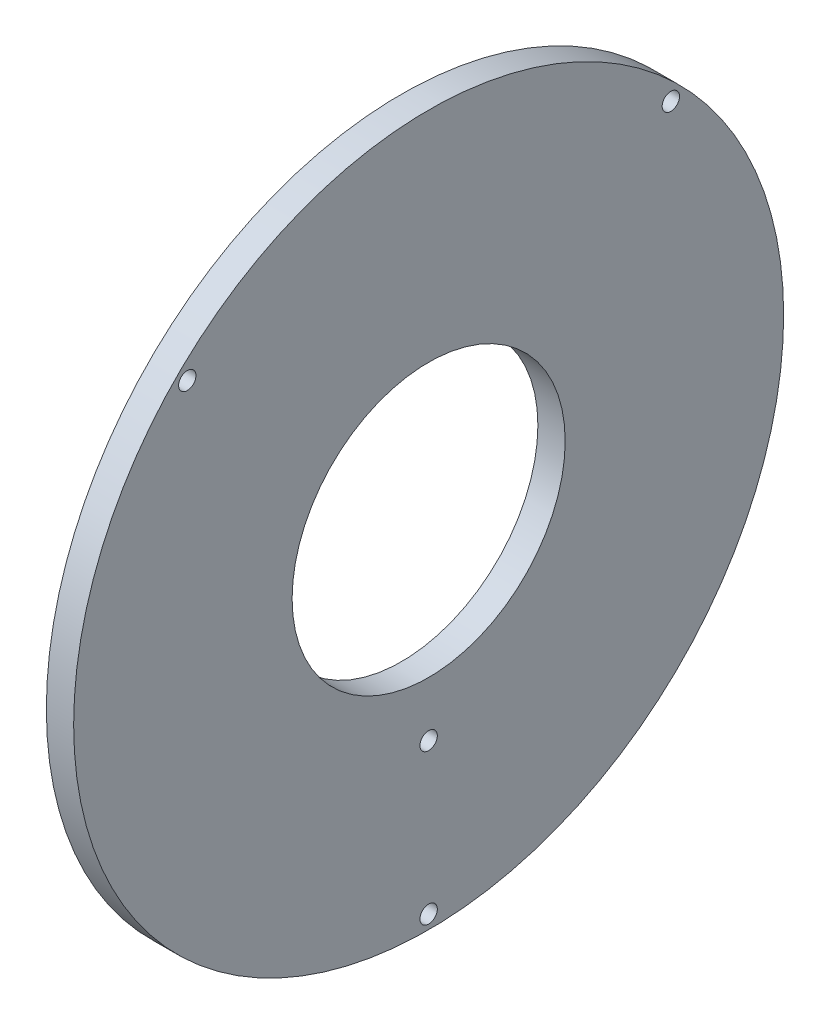
ISO-10303-21;
HEADER;
FILE_DESCRIPTION(('STEP AP214'),'2;1');
FILE_NAME('part.step','',(''),(''),'','','');
FILE_SCHEMA(('AUTOMOTIVE_DESIGN { 1 0 10303 214 1 1 1 1 }'));
ENDSEC;
DATA;
#1=APPLICATION_CONTEXT('core data for automotive mechanical design processes');
#2=APPLICATION_PROTOCOL_DEFINITION('international standard','automotive_design',2000,#1);
#3=PRODUCT_CONTEXT('',#1,'mechanical');
#4=PRODUCT('Part','Part','',(#3));
#5=PRODUCT_RELATED_PRODUCT_CATEGORY('part','',(#4));
#6=PRODUCT_DEFINITION_FORMATION('','',#4);
#7=PRODUCT_DEFINITION_CONTEXT('part definition',#1,'design');
#8=PRODUCT_DEFINITION('design','',#6,#7);
#9=PRODUCT_DEFINITION_SHAPE('','',#8);
#10=(LENGTH_UNIT() NAMED_UNIT(*) SI_UNIT(.MILLI.,.METRE.));
#11=(NAMED_UNIT(*) PLANE_ANGLE_UNIT() SI_UNIT($,.RADIAN.));
#12=(NAMED_UNIT(*) SI_UNIT($,.STERADIAN.) SOLID_ANGLE_UNIT());
#13=UNCERTAINTY_MEASURE_WITH_UNIT(LENGTH_MEASURE(1.E-05),#10,'distance_accuracy_value','');
#14=(GEOMETRIC_REPRESENTATION_CONTEXT(3) GLOBAL_UNCERTAINTY_ASSIGNED_CONTEXT((#13)) GLOBAL_UNIT_ASSIGNED_CONTEXT((#10,
#11,#12)) REPRESENTATION_CONTEXT('',''));
#15=CARTESIAN_POINT('',(0.,0.,0.));
#16=DIRECTION('',(0.,0.,1.));
#17=DIRECTION('',(1.,0.,0.));
#18=AXIS2_PLACEMENT_3D('',#15,#16,#17);
#19=CARTESIAN_POINT('',(20.,0.,0.));
#20=DIRECTION('',(-1.,0.,0.));
#21=DIRECTION('',(0.,0.,1.));
#22=AXIS2_PLACEMENT_3D('',#19,#20,#21);
#23=CYLINDRICAL_SURFACE('',#22,260.);
#24=CARTESIAN_POINT('',(20.,0.,0.));
#25=DIRECTION('',(1.,0.,0.));
#26=DIRECTION('',(0.,0.,-1.));
#27=AXIS2_PLACEMENT_3D('',#24,#25,#26);
#28=CIRCLE('',#27,260.);
#29=CARTESIAN_POINT('',(20.,0.,-260.));
#30=VERTEX_POINT('',#29);
#31=EDGE_CURVE('E11',#30,#30,#28,.T.);
#32=ORIENTED_EDGE('',*,*,#31,.F.);
#33=EDGE_LOOP('',(#32));
#34=FACE_BOUND('',#33,.T.);
#35=CARTESIAN_POINT('',(0.,0.,0.));
#36=DIRECTION('',(1.,0.,0.));
#37=DIRECTION('',(0.,0.,-1.));
#38=AXIS2_PLACEMENT_3D('',#35,#36,#37);
#39=CIRCLE('',#38,260.);
#40=CARTESIAN_POINT('',(0.,0.,-260.));
#41=VERTEX_POINT('',#40);
#42=EDGE_CURVE('E38',#41,#41,#39,.T.);
#43=ORIENTED_EDGE('',*,*,#42,.T.);
#44=EDGE_LOOP('',(#43));
#45=FACE_BOUND('',#44,.T.);
#46=ADVANCED_FACE('F31',(#34,#45),#23,.T.);
#47=CARTESIAN_POINT('',(20.,0.,0.));
#48=DIRECTION('',(1.,0.,0.));
#49=DIRECTION('',(0.,0.,-1.));
#50=AXIS2_PLACEMENT_3D('',#47,#48,#49);
#51=PLANE('',#50);
#52=CARTESIAN_POINT('',(20.,176.776695296637,-177.367627121048));
#53=DIRECTION('',(1.,0.,0.));
#54=DIRECTION('',(0.,0.,-1.));
#55=AXIS2_PLACEMENT_3D('',#52,#53,#54);
#56=CIRCLE('',#55,6.34999999999999);
#57=CARTESIAN_POINT('',(20.,176.776695296637,-183.717627121048));
#58=VERTEX_POINT('',#57);
#59=EDGE_CURVE('E68',#58,#58,#56,.T.);
#60=ORIENTED_EDGE('',*,*,#59,.F.);
#61=EDGE_LOOP('',(#60));
#62=FACE_BOUND('',#61,.T.);
#63=CARTESIAN_POINT('',(20.,176.776695296637,176.776695296637));
#64=DIRECTION('',(1.,0.,0.));
#65=DIRECTION('',(0.,0.,-1.));
#66=AXIS2_PLACEMENT_3D('',#63,#64,#65);
#67=CIRCLE('',#66,6.34999999999999);
#68=CARTESIAN_POINT('',(20.,176.776695296637,170.426695296637));
#69=VERTEX_POINT('',#68);
#70=EDGE_CURVE('E58',#69,#69,#67,.T.);
#71=ORIENTED_EDGE('',*,*,#70,.F.);
#72=EDGE_LOOP('',(#71));
#73=FACE_BOUND('',#72,.T.);
#74=CARTESIAN_POINT('',(20.,-250.,0.));
#75=DIRECTION('',(1.,0.,0.));
#76=DIRECTION('',(0.,0.,-1.));
#77=AXIS2_PLACEMENT_3D('',#74,#75,#76);
#78=CIRCLE('',#77,6.34999999999999);
#79=CARTESIAN_POINT('',(20.,-250.,-6.34999999999999));
#80=VERTEX_POINT('',#79);
#81=EDGE_CURVE('E55',#80,#80,#78,.T.);
#82=ORIENTED_EDGE('',*,*,#81,.F.);
#83=EDGE_LOOP('',(#82));
#84=FACE_BOUND('',#83,.T.);
#85=CARTESIAN_POINT('',(20.,-140.,0.));
#86=DIRECTION('',(1.,0.,0.));
#87=DIRECTION('',(0.,0.,-1.));
#88=AXIS2_PLACEMENT_3D('',#85,#86,#87);
#89=CIRCLE('',#88,6.34999999999999);
#90=CARTESIAN_POINT('',(20.,-140.,-6.34999999999999));
#91=VERTEX_POINT('',#90);
#92=EDGE_CURVE('E52',#91,#91,#89,.T.);
#93=ORIENTED_EDGE('',*,*,#92,.F.);
#94=EDGE_LOOP('',(#93));
#95=FACE_BOUND('',#94,.T.);
#96=CARTESIAN_POINT('',(20.,0.,0.));
#97=DIRECTION('',(1.,0.,0.));
#98=DIRECTION('',(0.,0.,-1.));
#99=AXIS2_PLACEMENT_3D('',#96,#97,#98);
#100=CIRCLE('',#99,100.);
#101=CARTESIAN_POINT('',(20.,0.,-100.));
#102=VERTEX_POINT('',#101);
#103=EDGE_CURVE('E46',#102,#102,#100,.T.);
#104=ORIENTED_EDGE('',*,*,#103,.F.);
#105=EDGE_LOOP('',(#104));
#106=FACE_BOUND('',#105,.T.);
#107=ORIENTED_EDGE('',*,*,#31,.T.);
#108=EDGE_LOOP('',(#107));
#109=FACE_BOUND('',#108,.T.);
#110=ADVANCED_FACE('F80',(#62,#73,#84,#95,#106,#109),#51,.T.);
#111=CARTESIAN_POINT('',(0.,0.,0.));
#112=DIRECTION('',(1.,0.,0.));
#113=DIRECTION('',(0.,0.,-1.));
#114=AXIS2_PLACEMENT_3D('',#111,#112,#113);
#115=PLANE('',#114);
#116=CARTESIAN_POINT('',(0.,176.776695296637,-177.367627121048));
#117=DIRECTION('',(1.,0.,0.));
#118=DIRECTION('',(0.,0.,-1.));
#119=AXIS2_PLACEMENT_3D('',#116,#117,#118);
#120=CIRCLE('',#119,6.34999999999999);
#121=CARTESIAN_POINT('',(0.,176.776695296637,-183.717627121048));
#122=VERTEX_POINT('',#121);
#123=EDGE_CURVE('E34',#122,#122,#120,.T.);
#124=ORIENTED_EDGE('',*,*,#123,.T.);
#125=EDGE_LOOP('',(#124));
#126=FACE_BOUND('',#125,.T.);
#127=CARTESIAN_POINT('',(0.,176.776695296637,176.776695296637));
#128=DIRECTION('',(1.,0.,0.));
#129=DIRECTION('',(0.,0.,-1.));
#130=AXIS2_PLACEMENT_3D('',#127,#128,#129);
#131=CIRCLE('',#130,6.34999999999999);
#132=CARTESIAN_POINT('',(0.,176.776695296637,170.426695296637));
#133=VERTEX_POINT('',#132);
#134=EDGE_CURVE('E56',#133,#133,#131,.T.);
#135=ORIENTED_EDGE('',*,*,#134,.T.);
#136=EDGE_LOOP('',(#135));
#137=FACE_BOUND('',#136,.T.);
#138=CARTESIAN_POINT('',(0.,-250.,0.));
#139=DIRECTION('',(1.,0.,0.));
#140=DIRECTION('',(0.,0.,-1.));
#141=AXIS2_PLACEMENT_3D('',#138,#139,#140);
#142=CIRCLE('',#141,6.34999999999999);
#143=CARTESIAN_POINT('',(0.,-250.,-6.34999999999999));
#144=VERTEX_POINT('',#143);
#145=EDGE_CURVE('E53',#144,#144,#142,.T.);
#146=ORIENTED_EDGE('',*,*,#145,.T.);
#147=EDGE_LOOP('',(#146));
#148=FACE_BOUND('',#147,.T.);
#149=CARTESIAN_POINT('',(0.,-140.,0.));
#150=DIRECTION('',(1.,0.,0.));
#151=DIRECTION('',(0.,0.,-1.));
#152=AXIS2_PLACEMENT_3D('',#149,#150,#151);
#153=CIRCLE('',#152,6.34999999999999);
#154=CARTESIAN_POINT('',(0.,-140.,-6.34999999999999));
#155=VERTEX_POINT('',#154);
#156=EDGE_CURVE('E49',#155,#155,#153,.T.);
#157=ORIENTED_EDGE('',*,*,#156,.T.);
#158=EDGE_LOOP('',(#157));
#159=FACE_BOUND('',#158,.T.);
#160=CARTESIAN_POINT('',(0.,0.,0.));
#161=DIRECTION('',(1.,0.,0.));
#162=DIRECTION('',(0.,0.,-1.));
#163=AXIS2_PLACEMENT_3D('',#160,#161,#162);
#164=CIRCLE('',#163,100.);
#165=CARTESIAN_POINT('',(0.,0.,-100.));
#166=VERTEX_POINT('',#165);
#167=EDGE_CURVE('E43',#166,#166,#164,.T.);
#168=ORIENTED_EDGE('',*,*,#167,.T.);
#169=EDGE_LOOP('',(#168));
#170=FACE_BOUND('',#169,.T.);
#171=ORIENTED_EDGE('',*,*,#42,.F.);
#172=EDGE_LOOP('',(#171));
#173=FACE_BOUND('',#172,.T.);
#174=ADVANCED_FACE('F82',(#126,#137,#148,#159,#170,#173),#115,.F.);
#175=CARTESIAN_POINT('',(0.,0.,0.));
#176=DIRECTION('',(1.,0.,0.));
#177=DIRECTION('',(0.,0.,-1.));
#178=AXIS2_PLACEMENT_3D('',#175,#176,#177);
#179=CYLINDRICAL_SURFACE('',#178,100.);
#180=ORIENTED_EDGE('',*,*,#167,.F.);
#181=EDGE_LOOP('',(#180));
#182=FACE_BOUND('',#181,.T.);
#183=ORIENTED_EDGE('',*,*,#103,.T.);
#184=EDGE_LOOP('',(#183));
#185=FACE_BOUND('',#184,.T.);
#186=ADVANCED_FACE('F78',(#182,#185),#179,.F.);
#187=CARTESIAN_POINT('',(20.,-140.,0.));
#188=DIRECTION('',(1.,0.,0.));
#189=DIRECTION('',(0.,0.,-1.));
#190=AXIS2_PLACEMENT_3D('',#187,#188,#189);
#191=CYLINDRICAL_SURFACE('',#190,6.34999999999999);
#192=ORIENTED_EDGE('',*,*,#92,.T.);
#193=EDGE_LOOP('',(#192));
#194=FACE_BOUND('',#193,.T.);
#195=ORIENTED_EDGE('',*,*,#156,.F.);
#196=EDGE_LOOP('',(#195));
#197=FACE_BOUND('',#196,.T.);
#198=ADVANCED_FACE('F97',(#194,#197),#191,.F.);
#199=CARTESIAN_POINT('',(20.,-250.,0.));
#200=DIRECTION('',(1.,0.,0.));
#201=DIRECTION('',(0.,0.,-1.));
#202=AXIS2_PLACEMENT_3D('',#199,#200,#201);
#203=CYLINDRICAL_SURFACE('',#202,6.34999999999999);
#204=ORIENTED_EDGE('',*,*,#81,.T.);
#205=EDGE_LOOP('',(#204));
#206=FACE_BOUND('',#205,.T.);
#207=ORIENTED_EDGE('',*,*,#145,.F.);
#208=EDGE_LOOP('',(#207));
#209=FACE_BOUND('',#208,.T.);
#210=ADVANCED_FACE('F101',(#206,#209),#203,.F.);
#211=CARTESIAN_POINT('',(20.,176.776695296637,176.776695296637));
#212=DIRECTION('',(1.,0.,0.));
#213=DIRECTION('',(0.,0.,-1.));
#214=AXIS2_PLACEMENT_3D('',#211,#212,#213);
#215=CYLINDRICAL_SURFACE('',#214,6.34999999999999);
#216=ORIENTED_EDGE('',*,*,#70,.T.);
#217=EDGE_LOOP('',(#216));
#218=FACE_BOUND('',#217,.T.);
#219=ORIENTED_EDGE('',*,*,#134,.F.);
#220=EDGE_LOOP('',(#219));
#221=FACE_BOUND('',#220,.T.);
#222=ADVANCED_FACE('F105',(#218,#221),#215,.F.);
#223=CARTESIAN_POINT('',(20.,176.776695296637,-177.367627121048));
#224=DIRECTION('',(1.,0.,0.));
#225=DIRECTION('',(0.,0.,-1.));
#226=AXIS2_PLACEMENT_3D('',#223,#224,#225);
#227=CYLINDRICAL_SURFACE('',#226,6.34999999999999);
#228=ORIENTED_EDGE('',*,*,#59,.T.);
#229=EDGE_LOOP('',(#228));
#230=FACE_BOUND('',#229,.T.);
#231=ORIENTED_EDGE('',*,*,#123,.F.);
#232=EDGE_LOOP('',(#231));
#233=FACE_BOUND('',#232,.T.);
#234=ADVANCED_FACE('F109',(#230,#233),#227,.F.);
#235=CLOSED_SHELL('',(#46,#110,#174,#186,#198,#210,#222,#234));
#236=MANIFOLD_SOLID_BREP('B2',#235);
#237=ADVANCED_BREP_SHAPE_REPRESENTATION('',(#18,#236),#14);
#238=SHAPE_DEFINITION_REPRESENTATION(#9,#237);
ENDSEC;
END-ISO-10303-21;
